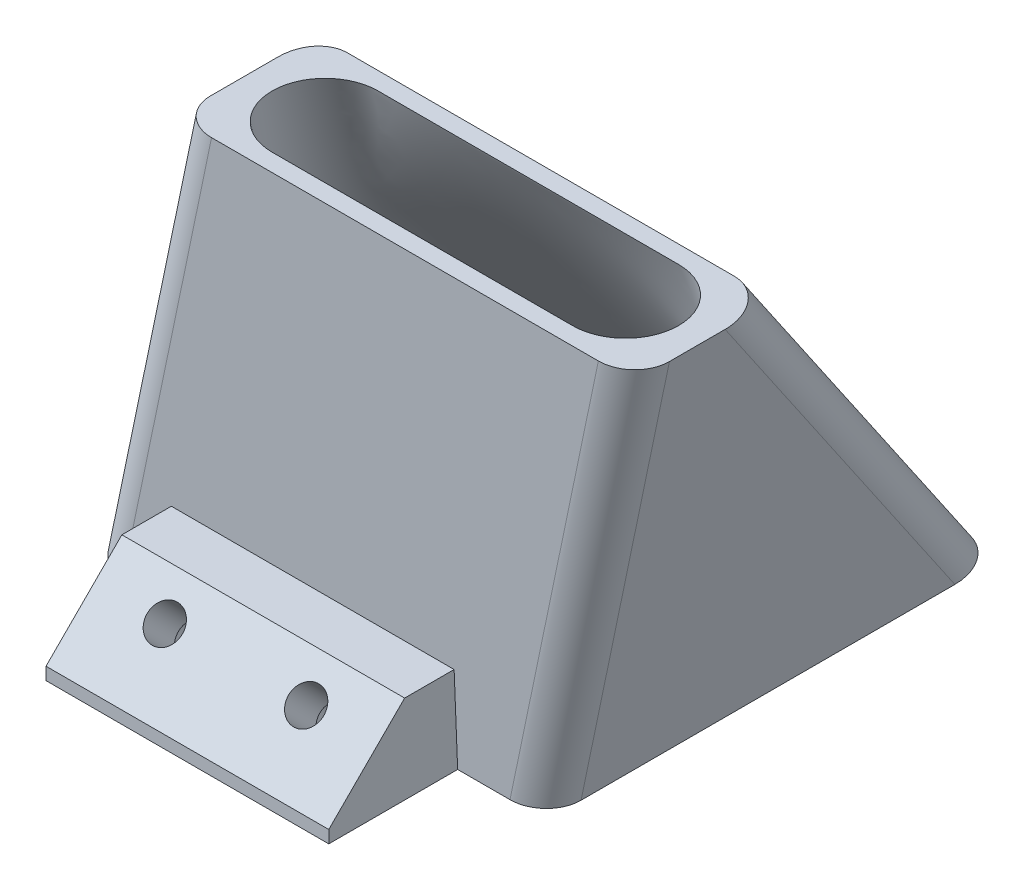
ISO-10303-21;
HEADER;
FILE_DESCRIPTION(('STEP AP214'),'2;1');
FILE_NAME('part.step','',(''),(''),'','','');
FILE_SCHEMA(('AUTOMOTIVE_DESIGN { 1 0 10303 214 1 1 1 1 }'));
ENDSEC;
DATA;
#1=APPLICATION_CONTEXT('core data for automotive mechanical design processes');
#2=APPLICATION_PROTOCOL_DEFINITION('international standard','automotive_design',2000,#1);
#3=PRODUCT_CONTEXT('',#1,'mechanical');
#4=PRODUCT('Part','Part','',(#3));
#5=PRODUCT_RELATED_PRODUCT_CATEGORY('part','',(#4));
#6=PRODUCT_DEFINITION_FORMATION('','',#4);
#7=PRODUCT_DEFINITION_CONTEXT('part definition',#1,'design');
#8=PRODUCT_DEFINITION('design','',#6,#7);
#9=PRODUCT_DEFINITION_SHAPE('','',#8);
#10=(LENGTH_UNIT() NAMED_UNIT(*) SI_UNIT(.MILLI.,.METRE.));
#11=(NAMED_UNIT(*) PLANE_ANGLE_UNIT() SI_UNIT($,.RADIAN.));
#12=(NAMED_UNIT(*) SI_UNIT($,.STERADIAN.) SOLID_ANGLE_UNIT());
#13=UNCERTAINTY_MEASURE_WITH_UNIT(LENGTH_MEASURE(1.E-05),#10,'distance_accuracy_value','');
#14=(GEOMETRIC_REPRESENTATION_CONTEXT(3) GLOBAL_UNCERTAINTY_ASSIGNED_CONTEXT((#13)) GLOBAL_UNIT_ASSIGNED_CONTEXT((#10,
#11,#12)) REPRESENTATION_CONTEXT('',''));
#15=CARTESIAN_POINT('',(0.,0.,0.));
#16=DIRECTION('',(0.,0.,1.));
#17=DIRECTION('',(1.,0.,0.));
#18=AXIS2_PLACEMENT_3D('',#15,#16,#17);
#19=CARTESIAN_POINT('',(0.,25.,0.));
#20=DIRECTION('',(0.,-1.,0.));
#21=DIRECTION('',(0.,0.,-1.));
#22=AXIS2_PLACEMENT_3D('',#19,#20,#21);
#23=PLANE('',#22);
#24=DIRECTION('',(1.,0.,0.));
#25=VECTOR('',#24,1.);
#26=CARTESIAN_POINT('',(14.5,25.,12.9999999999999));
#27=LINE('',#26,#25);
#28=CARTESIAN_POINT('',(-2.49999999820458,25.,12.9999999999999));
#29=VERTEX_POINT('',#28);
#30=CARTESIAN_POINT('',(14.5,25.,12.9999999999999));
#31=VERTEX_POINT('',#30);
#32=EDGE_CURVE('E332',#29,#31,#27,.T.);
#33=ORIENTED_EDGE('',*,*,#32,.F.);
#34=CARTESIAN_POINT('',(-2.5,25.,9.99999999999991));
#35=DIRECTION('',(0.,1.,0.));
#36=DIRECTION('',(0.,0.,1.));
#37=AXIS2_PLACEMENT_3D('',#34,#35,#36);
#38=CIRCLE('',#37,3.00000000000001);
#39=CARTESIAN_POINT('',(-2.49999999999999,25.,6.9999999999999));
#40=VERTEX_POINT('',#39);
#41=EDGE_CURVE('E426',#40,#29,#38,.T.);
#42=ORIENTED_EDGE('',*,*,#41,.F.);
#43=DIRECTION('',(-1.,0.,0.));
#44=VECTOR('',#43,1.);
#45=CARTESIAN_POINT('',(14.5,25.,6.99999999999991));
#46=LINE('',#45,#44);
#47=CARTESIAN_POINT('',(14.4999999998171,25.,6.99999999999991));
#48=VERTEX_POINT('',#47);
#49=EDGE_CURVE('E430',#48,#40,#46,.T.);
#50=ORIENTED_EDGE('',*,*,#49,.F.);
#51=CARTESIAN_POINT('',(14.5,25.,9.99999999999991));
#52=DIRECTION('',(0.,1.,0.));
#53=DIRECTION('',(0.,0.,1.));
#54=AXIS2_PLACEMENT_3D('',#51,#52,#53);
#55=CIRCLE('',#54,3.00000000000001);
#56=EDGE_CURVE('E427',#31,#48,#55,.T.);
#57=ORIENTED_EDGE('',*,*,#56,.F.);
#58=EDGE_LOOP('',(#33,#42,#50,#57));
#59=FACE_BOUND('',#58,.T.);
#60=DIRECTION('',(1.,0.,0.));
#61=VECTOR('',#60,1.);
#62=CARTESIAN_POINT('',(-7.,25.,13.9999999999999));
#63=LINE('',#62,#61);
#64=CARTESIAN_POINT('',(-4.92402172044335,25.,13.9999999999999));
#65=VERTEX_POINT('',#64);
#66=CARTESIAN_POINT('',(16.9623910372583,25.,13.9999999999999));
#67=VERTEX_POINT('',#66);
#68=EDGE_CURVE('E451',#65,#67,#63,.T.);
#69=ORIENTED_EDGE('',*,*,#68,.T.);
#70=CARTESIAN_POINT('',(16.9432063788508,25.,11.9984006394884));
#71=DIRECTION('',(0.,-1.,0.));
#72=DIRECTION('',(0.986393923832146,0.,0.164398987305344));
#73=AXIS2_PLACEMENT_3D('',#70,#71,#72);
#74=ELLIPSE('',#73,2.05834885284298,2.);
#75=CARTESIAN_POINT('',(19.,25.,12.0170704756865));
#76=VERTEX_POINT('',#75);
#77=EDGE_CURVE('E755',#67,#76,#74,.F.);
#78=ORIENTED_EDGE('',*,*,#77,.T.);
#79=DIRECTION('',(0.,0.,-1.));
#80=VECTOR('',#79,1.);
#81=CARTESIAN_POINT('',(19.,25.,13.9999999999999));
#82=LINE('',#81,#80);
#83=CARTESIAN_POINT('',(19.,25.,8.86677784265962));
#84=VERTEX_POINT('',#83);
#85=EDGE_CURVE('E698',#76,#84,#82,.T.);
#86=ORIENTED_EDGE('',*,*,#85,.T.);
#87=CARTESIAN_POINT('',(16.9432063788508,25.,8.51205095489712));
#88=DIRECTION('',(0.,-1.,0.));
#89=DIRECTION('',(0.301131367937099,0.,0.953582665134141));
#90=AXIS2_PLACEMENT_3D('',#87,#88,#89);
#91=ELLIPSE('',#90,2.55749877810332,2.);
#92=CARTESIAN_POINT('',(16.6527664104347,25.,5.99999999999992));
#93=VERTEX_POINT('',#92);
#94=EDGE_CURVE('E751',#84,#93,#91,.F.);
#95=ORIENTED_EDGE('',*,*,#94,.T.);
#96=DIRECTION('',(-1.,0.,0.));
#97=VECTOR('',#96,1.);
#98=CARTESIAN_POINT('',(-7.,25.,5.99999999999992));
#99=LINE('',#98,#97);
#100=CARTESIAN_POINT('',(-5.23364634726691,25.,5.99999999999992));
#101=VERTEX_POINT('',#100);
#102=EDGE_CURVE('E694',#93,#101,#99,.T.);
#103=ORIENTED_EDGE('',*,*,#102,.T.);
#104=CARTESIAN_POINT('',(-4.94320637885081,25.,8.51205095489713));
#105=DIRECTION('',(0.,-1.,0.));
#106=DIRECTION('',(0.301131367937099,0.,0.953582665134141));
#107=AXIS2_PLACEMENT_3D('',#104,#105,#106);
#108=ELLIPSE('',#107,2.55749877810332,2.);
#109=CARTESIAN_POINT('',(-7.,25.,8.15732406713463));
#110=VERTEX_POINT('',#109);
#111=EDGE_CURVE('E747',#101,#110,#108,.F.);
#112=ORIENTED_EDGE('',*,*,#111,.T.);
#113=DIRECTION('',(0.,0.,1.));
#114=VECTOR('',#113,1.);
#115=CARTESIAN_POINT('',(-7.,25.,13.9999999999999));
#116=LINE('',#115,#114);
#117=CARTESIAN_POINT('',(-7.,25.,11.9797308032904));
#118=VERTEX_POINT('',#117);
#119=EDGE_CURVE('E425',#110,#118,#116,.T.);
#120=ORIENTED_EDGE('',*,*,#119,.T.);
#121=CARTESIAN_POINT('',(-4.94320637885081,25.,11.9984006394884));
#122=DIRECTION('',(0.,-1.,0.));
#123=DIRECTION('',(0.986393923832146,0.,0.164398987305344));
#124=AXIS2_PLACEMENT_3D('',#121,#122,#123);
#125=ELLIPSE('',#124,2.05834885284298,2.);
#126=EDGE_CURVE('E661',#118,#65,#125,.F.);
#127=ORIENTED_EDGE('',*,*,#126,.T.);
#128=EDGE_LOOP('',(#69,#78,#86,#95,#103,#112,#120,#127));
#129=FACE_BOUND('',#128,.T.);
#130=ADVANCED_FACE('F138',(#59,#129),#23,.F.);
#131=CARTESIAN_POINT('',(0.,0.,0.));
#132=DIRECTION('',(0.,1.,0.));
#133=DIRECTION('',(0.,0.,1.));
#134=AXIS2_PLACEMENT_3D('',#131,#132,#133);
#135=PLANE('',#134);
#136=CARTESIAN_POINT('',(4.,0.,14.1421356237309));
#137=DIRECTION('',(0.,1.,0.));
#138=DIRECTION('',(0.,0.,1.));
#139=AXIS2_PLACEMENT_3D('',#136,#137,#138);
#140=ELLIPSE('',#139,2.47487373415291,1.75);
#141=CARTESIAN_POINT('',(4.,0.,16.6170093578838));
#142=VERTEX_POINT('',#141);
#143=EDGE_CURVE('E568',#142,#142,#140,.T.);
#144=ORIENTED_EDGE('',*,*,#143,.T.);
#145=EDGE_LOOP('',(#144));
#146=FACE_BOUND('',#145,.T.);
#147=CARTESIAN_POINT('',(-4.,0.,14.1421356237309));
#148=DIRECTION('',(0.,1.,0.));
#149=DIRECTION('',(0.,0.,1.));
#150=AXIS2_PLACEMENT_3D('',#147,#148,#149);
#151=ELLIPSE('',#150,2.47487373415291,1.75);
#152=CARTESIAN_POINT('',(-4.,0.,16.6170093578838));
#153=VERTEX_POINT('',#152);
#154=EDGE_CURVE('E571',#153,#153,#151,.T.);
#155=ORIENTED_EDGE('',*,*,#154,.T.);
#156=EDGE_LOOP('',(#155));
#157=FACE_BOUND('',#156,.T.);
#158=DIRECTION('',(0.,0.,1.));
#159=VECTOR('',#158,1.);
#160=CARTESIAN_POINT('',(8.,0.,21.));
#161=LINE('',#160,#159);
#162=CARTESIAN_POINT('',(8.,0.,13.));
#163=VERTEX_POINT('',#162);
#164=CARTESIAN_POINT('',(8.,0.,20.2928932188134));
#165=VERTEX_POINT('',#164);
#166=EDGE_CURVE('E269',#163,#165,#161,.T.);
#167=ORIENTED_EDGE('',*,*,#166,.T.);
#168=DIRECTION('',(-1.,0.,0.));
#169=VECTOR('',#168,1.);
#170=CARTESIAN_POINT('',(-8.,0.,20.2928932188134));
#171=LINE('',#170,#169);
#172=CARTESIAN_POINT('',(-8.,0.,20.2928932188134));
#173=VERTEX_POINT('',#172);
#174=EDGE_CURVE('E588',#165,#173,#171,.T.);
#175=ORIENTED_EDGE('',*,*,#174,.T.);
#176=DIRECTION('',(0.,0.,-1.));
#177=VECTOR('',#176,1.);
#178=CARTESIAN_POINT('',(-8.,0.,21.));
#179=LINE('',#178,#177);
#180=CARTESIAN_POINT('',(-8.,0.,13.));
#181=VERTEX_POINT('',#180);
#182=EDGE_CURVE('E298',#173,#181,#179,.T.);
#183=ORIENTED_EDGE('',*,*,#182,.T.);
#184=DIRECTION('',(1.,0.,0.));
#185=VECTOR('',#184,1.);
#186=CARTESIAN_POINT('',(-13.,0.,13.));
#187=LINE('',#186,#185);
#188=CARTESIAN_POINT('',(-10.9240217204434,0.,13.));
#189=VERTEX_POINT('',#188);
#190=EDGE_CURVE('E278',#189,#181,#187,.T.);
#191=ORIENTED_EDGE('',*,*,#190,.F.);
#192=CARTESIAN_POINT('',(-10.9432063788508,0.,10.9984006394885));
#193=DIRECTION('',(0.,1.,0.));
#194=DIRECTION('',(0.986393923832146,0.,0.164398987305344));
#195=AXIS2_PLACEMENT_3D('',#192,#193,#194);
#196=ELLIPSE('',#195,2.05834885284298,2.);
#197=CARTESIAN_POINT('',(-13.,0.,10.9797308032905));
#198=VERTEX_POINT('',#197);
#199=EDGE_CURVE('E771',#189,#198,#196,.F.);
#200=ORIENTED_EDGE('',*,*,#199,.T.);
#201=DIRECTION('',(0.,0.,1.));
#202=VECTOR('',#201,1.);
#203=CARTESIAN_POINT('',(-13.,0.,-13.));
#204=LINE('',#203,#202);
#205=CARTESIAN_POINT('',(-13.,0.,-10.8426759328653));
#206=VERTEX_POINT('',#205);
#207=EDGE_CURVE('E279',#206,#198,#204,.T.);
#208=ORIENTED_EDGE('',*,*,#207,.F.);
#209=CARTESIAN_POINT('',(-10.9432063788508,0.,-10.4879490451028));
#210=DIRECTION('',(0.,1.,0.));
#211=DIRECTION('',(0.301131367937099,0.,0.953582665134141));
#212=AXIS2_PLACEMENT_3D('',#209,#210,#211);
#213=ELLIPSE('',#212,2.55749877810332,2.);
#214=CARTESIAN_POINT('',(-11.2336463472669,0.,-13.));
#215=VERTEX_POINT('',#214);
#216=EDGE_CURVE('E1056',#206,#215,#213,.F.);
#217=ORIENTED_EDGE('',*,*,#216,.T.);
#218=DIRECTION('',(-1.,0.,0.));
#219=VECTOR('',#218,1.);
#220=CARTESIAN_POINT('',(-13.,0.,-13.));
#221=LINE('',#220,#219);
#222=CARTESIAN_POINT('',(10.6527664104347,0.,-13.));
#223=VERTEX_POINT('',#222);
#224=EDGE_CURVE('E657',#223,#215,#221,.T.);
#225=ORIENTED_EDGE('',*,*,#224,.F.);
#226=CARTESIAN_POINT('',(10.9432063788508,0.,-10.4879490451028));
#227=DIRECTION('',(0.,1.,0.));
#228=DIRECTION('',(0.301131367937099,0.,0.953582665134141));
#229=AXIS2_PLACEMENT_3D('',#226,#227,#228);
#230=ELLIPSE('',#229,2.55749877810332,2.);
#231=CARTESIAN_POINT('',(13.,0.,-10.1332221573403));
#232=VERTEX_POINT('',#231);
#233=EDGE_CURVE('E1057',#223,#232,#230,.F.);
#234=ORIENTED_EDGE('',*,*,#233,.T.);
#235=DIRECTION('',(0.,0.,-1.));
#236=VECTOR('',#235,1.);
#237=CARTESIAN_POINT('',(13.,0.,-13.));
#238=LINE('',#237,#236);
#239=CARTESIAN_POINT('',(13.,0.,11.0170704756865));
#240=VERTEX_POINT('',#239);
#241=EDGE_CURVE('E630',#240,#232,#238,.T.);
#242=ORIENTED_EDGE('',*,*,#241,.F.);
#243=CARTESIAN_POINT('',(10.9432063788508,0.,10.9984006394885));
#244=DIRECTION('',(0.,1.,0.));
#245=DIRECTION('',(0.986393923832146,0.,0.164398987305344));
#246=AXIS2_PLACEMENT_3D('',#243,#244,#245);
#247=ELLIPSE('',#246,2.05834885284298,2.);
#248=CARTESIAN_POINT('',(10.9623910372583,0.,13.));
#249=VERTEX_POINT('',#248);
#250=EDGE_CURVE('E273',#240,#249,#247,.F.);
#251=ORIENTED_EDGE('',*,*,#250,.T.);
#252=EDGE_CURVE('E262',#163,#249,#187,.T.);
#253=ORIENTED_EDGE('',*,*,#252,.F.);
#254=EDGE_LOOP('',(#167,#175,#183,#191,#200,#208,#217,#225,#234,#242,#251,#253));
#255=FACE_BOUND('',#254,.T.);
#256=CARTESIAN_POINT('',(-10.,0.,-10.));
#257=DIRECTION('',(0.,-1.,0.));
#258=DIRECTION('',(0.,0.,1.));
#259=AXIS2_PLACEMENT_3D('',#256,#257,#258);
#260=CIRCLE('',#259,0.999999999999999);
#261=CARTESIAN_POINT('',(-10.,0.,-9.));
#262=VERTEX_POINT('',#261);
#263=EDGE_CURVE('E308',#262,#262,#260,.T.);
#264=ORIENTED_EDGE('',*,*,#263,.F.);
#265=EDGE_LOOP('',(#264));
#266=FACE_BOUND('',#265,.T.);
#267=CARTESIAN_POINT('',(10.,0.,-10.));
#268=DIRECTION('',(0.,-1.,0.));
#269=DIRECTION('',(0.,0.,-1.));
#270=AXIS2_PLACEMENT_3D('',#267,#268,#269);
#271=CIRCLE('',#270,0.999999999999999);
#272=CARTESIAN_POINT('',(10.,0.,-11.));
#273=VERTEX_POINT('',#272);
#274=EDGE_CURVE('E312',#273,#273,#271,.T.);
#275=ORIENTED_EDGE('',*,*,#274,.F.);
#276=EDGE_LOOP('',(#275));
#277=FACE_BOUND('',#276,.T.);
#278=CARTESIAN_POINT('',(10.,0.,10.));
#279=DIRECTION('',(0.,-1.,0.));
#280=DIRECTION('',(0.,0.,1.));
#281=AXIS2_PLACEMENT_3D('',#278,#279,#280);
#282=CIRCLE('',#281,0.999999999999999);
#283=CARTESIAN_POINT('',(10.,0.,11.));
#284=VERTEX_POINT('',#283);
#285=EDGE_CURVE('E320',#284,#284,#282,.T.);
#286=ORIENTED_EDGE('',*,*,#285,.F.);
#287=EDGE_LOOP('',(#286));
#288=FACE_BOUND('',#287,.T.);
#289=CARTESIAN_POINT('',(-10.,0.,10.));
#290=DIRECTION('',(0.,-1.,0.));
#291=DIRECTION('',(0.,0.,-1.));
#292=AXIS2_PLACEMENT_3D('',#289,#290,#291);
#293=CIRCLE('',#292,0.999999999999999);
#294=CARTESIAN_POINT('',(-10.,0.,9.));
#295=VERTEX_POINT('',#294);
#296=EDGE_CURVE('E319',#295,#295,#293,.T.);
#297=ORIENTED_EDGE('',*,*,#296,.F.);
#298=EDGE_LOOP('',(#297));
#299=FACE_BOUND('',#298,.T.);
#300=CARTESIAN_POINT('',(0.,0.,0.));
#301=DIRECTION('',(0.,-1.,0.));
#302=DIRECTION('',(0.,0.,-1.));
#303=AXIS2_PLACEMENT_3D('',#300,#301,#302);
#304=CIRCLE('',#303,11.5);
#305=CARTESIAN_POINT('',(-10.6402403849438,0.,4.36294448172448));
#306=VERTEX_POINT('',#305);
#307=CARTESIAN_POINT('',(-11.0216045895966,0.,-3.28241256861229));
#308=VERTEX_POINT('',#307);
#309=EDGE_CURVE('E420',#306,#308,#304,.T.);
#310=ORIENTED_EDGE('',*,*,#309,.F.);
#311=CARTESIAN_POINT('',(11.0216045895966,0.,3.2824125686123));
#312=VERTEX_POINT('',#311);
#313=EDGE_CURVE('E326',#312,#306,#304,.T.);
#314=ORIENTED_EDGE('',*,*,#313,.F.);
#315=CARTESIAN_POINT('',(10.6402403851226,0.,-4.36294448128858));
#316=VERTEX_POINT('',#315);
#317=EDGE_CURVE('E422',#316,#312,#304,.T.);
#318=ORIENTED_EDGE('',*,*,#317,.F.);
#319=EDGE_CURVE('E415',#308,#316,#304,.T.);
#320=ORIENTED_EDGE('',*,*,#319,.F.);
#321=EDGE_LOOP('',(#310,#314,#318,#320));
#322=FACE_BOUND('',#321,.T.);
#323=ADVANCED_FACE('F265',(#146,#157,#255,#266,#277,#288,#299,#322),#135,.F.);
#324=CARTESIAN_POINT('',(12.2919818456883,-2.95007564296521,0.));
#325=DIRECTION('',(-0.972387301980517,0.233372952475325,0.));
#326=DIRECTION('',(-0.233372952475325,-0.972387301980517,0.));
#327=AXIS2_PLACEMENT_3D('',#324,#325,#326);
#328=PLANE('',#327);
#329=ORIENTED_EDGE('',*,*,#85,.F.);
#330=DIRECTION('',(0.233196622300942,0.97165259292059,0.0388661037168203));
#331=VECTOR('',#330,1.);
#332=CARTESIAN_POINT('',(12.1931987570179,-3.36167184575852,10.8826036018562));
#333=LINE('',#332,#331);
#334=EDGE_CURVE('E767',#76,#240,#333,.F.);
#335=ORIENTED_EDGE('',*,*,#334,.T.);
#336=ORIENTED_EDGE('',*,*,#241,.T.);
#337=DIRECTION('',(0.187683374126957,0.782014058862319,0.59433068473536));
#338=VECTOR('',#337,1.);
#339=CARTESIAN_POINT('',(13.6723946437738,2.80164434905737,-8.00397245205671));
#340=LINE('',#339,#338);
#341=EDGE_CURVE('E759',#232,#84,#340,.T.);
#342=ORIENTED_EDGE('',*,*,#341,.T.);
#343=EDGE_LOOP('',(#329,#335,#336,#342));
#344=FACE_BOUND('',#343,.T.);
#345=ADVANCED_FACE('F559',(#344),#328,.F.);
#346=CARTESIAN_POINT('',(0.,-0.519169329073439,12.9792332268371));
#347=DIRECTION('',(0.,0.0399680383488682,-0.999200958721789));
#348=DIRECTION('',(0.,0.99920095872179,0.0399680383488682));
#349=AXIS2_PLACEMENT_3D('',#346,#347,#348);
#350=PLANE('',#349);
#351=ORIENTED_EDGE('',*,*,#190,.T.);
#352=DIRECTION('',(0.,0.99920095872179,0.0399680383488682));
#353=VECTOR('',#352,1.);
#354=CARTESIAN_POINT('',(-8.,-0.519169329073439,12.9792332268371));
#355=LINE('',#354,#353);
#356=CARTESIAN_POINT('',(-8.,5.,13.2));
#357=VERTEX_POINT('',#356);
#358=EDGE_CURVE('E293',#181,#357,#355,.T.);
#359=ORIENTED_EDGE('',*,*,#358,.T.);
#360=DIRECTION('',(-1.,0.,0.));
#361=VECTOR('',#360,1.);
#362=CARTESIAN_POINT('',(0.,5.,13.2));
#363=LINE('',#362,#361);
#364=CARTESIAN_POINT('',(8.,5.,13.2));
#365=VERTEX_POINT('',#364);
#366=EDGE_CURVE('E289',#365,#357,#363,.T.);
#367=ORIENTED_EDGE('',*,*,#366,.F.);
#368=DIRECTION('',(0.,-0.99920095872179,-0.0399680383488682));
#369=VECTOR('',#368,1.);
#370=CARTESIAN_POINT('',(8.,-0.519169329073439,12.9792332268371));
#371=LINE('',#370,#369);
#372=EDGE_CURVE('E284',#365,#163,#371,.T.);
#373=ORIENTED_EDGE('',*,*,#372,.T.);
#374=ORIENTED_EDGE('',*,*,#252,.T.);
#375=DIRECTION('',(0.233196622300942,0.97165259292059,0.0388661037168203));
#376=VECTOR('',#375,1.);
#377=CARTESIAN_POINT('',(10.2484241530569,-2.97486201750561,12.8810055192998));
#378=LINE('',#377,#376);
#379=EDGE_CURVE('E656',#249,#67,#378,.T.);
#380=ORIENTED_EDGE('',*,*,#379,.T.);
#381=ORIENTED_EDGE('',*,*,#68,.F.);
#382=DIRECTION('',(0.233196622300942,0.97165259292059,0.0388661037168203));
#383=VECTOR('',#382,1.);
#384=CARTESIAN_POINT('',(-10.4477909320204,1.98429495176213,13.0793717980705));
#385=LINE('',#384,#383);
#386=EDGE_CURVE('E654',#65,#189,#385,.F.);
#387=ORIENTED_EDGE('',*,*,#386,.T.);
#388=EDGE_LOOP('',(#351,#359,#367,#373,#374,#380,#381,#387));
#389=FACE_BOUND('',#388,.T.);
#390=ADVANCED_FACE('F286',(#389),#350,.F.);
#391=CARTESIAN_POINT('',(0.,6.26267748478701,-8.24036511156189));
#392=DIRECTION('',(0.,-0.605083267533556,0.796162194123104));
#393=DIRECTION('',(0.,-0.796162194123104,-0.605083267533556));
#394=AXIS2_PLACEMENT_3D('',#391,#392,#393);
#395=PLANE('',#394);
#396=ORIENTED_EDGE('',*,*,#102,.F.);
#397=DIRECTION('',(0.187683374126957,0.782014058862319,0.59433068473536));
#398=VECTOR('',#397,1.);
#399=CARTESIAN_POINT('',(11.7276200398127,4.47855678907513,-9.59629684030292));
#400=LINE('',#399,#398);
#401=EDGE_CURVE('E811',#93,#223,#400,.F.);
#402=ORIENTED_EDGE('',*,*,#401,.T.);
#403=ORIENTED_EDGE('',*,*,#224,.T.);
#404=DIRECTION('',(0.187683374126957,0.782014058862319,0.59433068473536));
#405=VECTOR('',#404,1.);
#406=CARTESIAN_POINT('',(-9.38784275773501,7.69084828971628,-7.15495529981566));
#407=LINE('',#406,#405);
#408=CARTESIAN_POINT('',(-10.5500116997172,2.84847769812395,-10.8351569494258));
#409=VERTEX_POINT('',#408);
#410=EDGE_CURVE('E1071',#215,#409,#407,.T.);
#411=ORIENTED_EDGE('',*,*,#410,.T.);
#412=CARTESIAN_POINT('',(-10.,3.94736842105265,-10.));
#413=DIRECTION('',(0.,-0.605083267533556,0.796162194123104));
#414=DIRECTION('',(0.,-0.796162194123104,-0.605083267533556));
#415=AXIS2_PLACEMENT_3D('',#412,#413,#414);
#416=ELLIPSE('',#415,1.65266510190606,0.999999999999999);
#417=CARTESIAN_POINT('',(-9.97062473032492,5.26259007059165,-9.00043154635037));
#418=VERTEX_POINT('',#417);
#419=EDGE_CURVE('E311',#409,#418,#416,.T.);
#420=ORIENTED_EDGE('',*,*,#419,.T.);
#421=DIRECTION('',(0.187683374126957,0.782014058862319,0.59433068473536));
#422=VECTOR('',#421,1.);
#423=CARTESIAN_POINT('',(-9.38784275773501,7.69084828971628,-7.15495529981566));
#424=LINE('',#423,#422);
#425=EDGE_CURVE('E1067',#418,#101,#424,.T.);
#426=ORIENTED_EDGE('',*,*,#425,.T.);
#427=EDGE_LOOP('',(#396,#402,#403,#411,#420,#426));
#428=FACE_BOUND('',#427,.T.);
#429=CARTESIAN_POINT('',(10.,3.94736842105265,-10.));
#430=DIRECTION('',(0.,-0.605083267533556,0.796162194123104));
#431=DIRECTION('',(0.,-0.796162194123104,-0.605083267533556));
#432=AXIS2_PLACEMENT_3D('',#429,#430,#431);
#433=ELLIPSE('',#432,1.65266510190606,0.999999999999999);
#434=CARTESIAN_POINT('',(10.,2.63157894736844,-11.));
#435=VERTEX_POINT('',#434);
#436=EDGE_CURVE('E315',#435,#435,#433,.T.);
#437=ORIENTED_EDGE('',*,*,#436,.T.);
#438=EDGE_LOOP('',(#437));
#439=FACE_BOUND('',#438,.T.);
#440=ADVANCED_FACE('F717',(#428,#439),#395,.F.);
#441=CARTESIAN_POINT('',(-12.2919818456884,2.95007564296521,0.));
#442=DIRECTION('',(0.972387301980517,-0.233372952475324,0.));
#443=DIRECTION('',(0.233372952475324,0.972387301980517,0.));
#444=AXIS2_PLACEMENT_3D('',#441,#442,#443);
#445=PLANE('',#444);
#446=ORIENTED_EDGE('',*,*,#119,.F.);
#447=DIRECTION('',(0.187683374126957,0.782014058862319,0.59433068473536));
#448=VECTOR('',#447,1.);
#449=CARTESIAN_POINT('',(-11.332617361696,6.94742765959981,-5.56263091156945));
#450=LINE('',#449,#448);
#451=EDGE_CURVE('E798',#110,#206,#450,.F.);
#452=ORIENTED_EDGE('',*,*,#451,.T.);
#453=ORIENTED_EDGE('',*,*,#207,.T.);
#454=DIRECTION('',(0.233196622300942,0.97165259292059,0.0388661037168203));
#455=VECTOR('',#454,1.);
#456=CARTESIAN_POINT('',(-12.3925655359815,2.53097693341052,11.0809698806269));
#457=LINE('',#456,#455);
#458=EDGE_CURVE('E800',#198,#118,#457,.T.);
#459=ORIENTED_EDGE('',*,*,#458,.T.);
#460=EDGE_LOOP('',(#446,#452,#453,#459));
#461=FACE_BOUND('',#460,.T.);
#462=ADVANCED_FACE('F352',(#461),#445,.F.);
#463=CARTESIAN_POINT('',(-2.49999999820458,25.,12.9999999999999));
#464=CARTESIAN_POINT('',(-10.6402403849438,0.,4.36294448172448));
#465=CARTESIAN_POINT('',(-2.81526125219568,25.,12.9999999999999));
#466=CARTESIAN_POINT('',(-10.8037671362267,0.,3.96413951170701));
#467=CARTESIAN_POINT('',(-3.48518305167077,25.0000000000001,12.9006204718999));
#468=CARTESIAN_POINT('',(-11.0413822433789,0.,3.26632807008249));
#469=CARTESIAN_POINT('',(-4.49375113023656,24.9999999999999,12.3482025138626));
#470=CARTESIAN_POINT('',(-11.2754621249926,0.,2.3253907760856));
#471=CARTESIAN_POINT('',(-5.29167901815688,25.0000000000001,11.3415272283433));
#472=CARTESIAN_POINT('',(-11.420477177352,0.,1.43974941400559));
#473=CARTESIAN_POINT('',(-5.60497729700984,25.,9.99999999999994));
#474=CARTESIAN_POINT('',(-11.4967524390815,0.,0.573481706152424));
#475=CARTESIAN_POINT('',(-5.29167901815686,25.,8.6584727716565));
#476=CARTESIAN_POINT('',(-11.5071086948946,0.,-0.296015988010232));
#477=CARTESIAN_POINT('',(-4.49375113023657,25.,7.65179748613722));
#478=CARTESIAN_POINT('',(-11.4508849452292,0.,-1.19179242928072));
#479=CARTESIAN_POINT('',(-3.48518305167076,25.,7.09937952809989));
#480=CARTESIAN_POINT('',(-11.311633740644,0.,-2.15130198351375));
#481=CARTESIAN_POINT('',(-2.81526125219568,25.,6.99999999999991));
#482=CARTESIAN_POINT('',(-11.1446321150282,0.,-2.86931375467572));
#483=CARTESIAN_POINT('',(-1.71422883967938,25.,6.99999999999991));
#484=CARTESIAN_POINT('',(-10.7149653178397,0.,-4.31203841067227));
#485=CARTESIAN_POINT('',(-0.209201496978708,25.,6.99999999999991));
#486=CARTESIAN_POINT('',(-9.7915212882665,0.,-6.3504391194931));
#487=CARTESIAN_POINT('',(1.91555403210623,25.,6.99999999999991));
#488=CARTESIAN_POINT('',(-7.4463321081483,0.,-9.00875305051836));
#489=CARTESIAN_POINT('',(3.97428352508072,25.,6.99999999999991));
#490=CARTESIAN_POINT('',(-4.2714417090761,0.,-10.8924885301232));
#491=CARTESIAN_POINT('',(6.,25.,6.9999999999999));
#492=CARTESIAN_POINT('',(-0.583125068405685,0.,-11.6901358344804));
#493=CARTESIAN_POINT('',(8.02571647491928,25.,6.9999999999999));
#494=CARTESIAN_POINT('',(3.16626129480691,0.,-11.2634945761033));
#495=CARTESIAN_POINT('',(10.0844459678938,25.,6.99999999999991));
#496=CARTESIAN_POINT('',(6.51285322727913,0.,-9.70506240216845));
#497=CARTESIAN_POINT('',(12.2092014969787,25.,6.99999999999991));
#498=CARTESIAN_POINT('',(9.11094555278082,0.,-7.29332827200502));
#499=CARTESIAN_POINT('',(13.7142288396794,25.,6.99999999999991));
#500=CARTESIAN_POINT('',(10.2326590435049,0.,-5.35694371045648));
#501=CARTESIAN_POINT('',(14.8152612521957,25.,6.99999999999991));
#502=CARTESIAN_POINT('',(10.8037671362267,0.,-3.96413951170701));
#503=CARTESIAN_POINT('',(15.4851830516708,25.,7.09937952809991));
#504=CARTESIAN_POINT('',(11.0413822433789,0.,-3.26632807008248));
#505=CARTESIAN_POINT('',(16.4937511302366,25.,7.65179748613718));
#506=CARTESIAN_POINT('',(11.2754621249926,0.,-2.3253907760856));
#507=CARTESIAN_POINT('',(17.2916790181569,25.,8.65847277165655));
#508=CARTESIAN_POINT('',(11.420477177352,0.,-1.43974941400558));
#509=CARTESIAN_POINT('',(17.6049772970098,25.,9.99999999999989));
#510=CARTESIAN_POINT('',(11.4967524390815,0.,-0.573481706152415));
#511=CARTESIAN_POINT('',(17.2916790181569,25.,11.3415272283433));
#512=CARTESIAN_POINT('',(11.5071086948946,0.,0.296015988010235));
#513=CARTESIAN_POINT('',(16.4937511302365,25.,12.3482025138626));
#514=CARTESIAN_POINT('',(11.4508849452292,0.,1.19179242928073));
#515=CARTESIAN_POINT('',(15.4851830516708,25.,12.9006204718999));
#516=CARTESIAN_POINT('',(11.311633740644,0.,2.15130198351375));
#517=CARTESIAN_POINT('',(14.8152612521957,25.,12.9999999999999));
#518=CARTESIAN_POINT('',(11.1446321150282,0.,2.86931375467572));
#519=CARTESIAN_POINT('',(13.7142288396794,25.,12.9999999999999));
#520=CARTESIAN_POINT('',(10.7149653178397,0.,4.31203841067227));
#521=CARTESIAN_POINT('',(12.2092014969787,25.,12.9999999999999));
#522=CARTESIAN_POINT('',(9.79152128826649,0.,6.35043911949313));
#523=CARTESIAN_POINT('',(10.0844459678938,25.,12.9999999999999));
#524=CARTESIAN_POINT('',(7.4463321081483,0.,9.00875305051834));
#525=CARTESIAN_POINT('',(8.02571647491927,25.,12.9999999999999));
#526=CARTESIAN_POINT('',(4.27144170907609,0.,10.8924885301233));
#527=CARTESIAN_POINT('',(6.00000000000001,25.,12.9999999999999));
#528=CARTESIAN_POINT('',(0.58312506840568,0.,11.6901358344804));
#529=CARTESIAN_POINT('',(3.97428352508073,25.,12.9999999999999));
#530=CARTESIAN_POINT('',(-3.16626129480693,0.,11.2634945761033));
#531=CARTESIAN_POINT('',(1.91555403210623,25.,12.9999999999999));
#532=CARTESIAN_POINT('',(-6.51285322727912,0.,9.70506240216842));
#533=CARTESIAN_POINT('',(-0.209201496978711,25.,12.9999999999999));
#534=CARTESIAN_POINT('',(-9.11094555278084,0.,7.29332827200504));
#535=CARTESIAN_POINT('',(-1.71422883967938,25.,12.9999999999999));
#536=CARTESIAN_POINT('',(-10.2326590435049,0.,5.35694371045648));
#537=CARTESIAN_POINT('',(-2.49999999820458,25.,12.9999999999999));
#538=CARTESIAN_POINT('',(-10.6402403849438,0.,4.36294448172448));
#539=B_SPLINE_SURFACE_WITH_KNOTS('',3,1,((#463,#464),(#465,#466),(#467,#468),(#469,#470),(#471,
#472),(#473,#474),(#475,#476),(#477,#478),(#479,#480),(#481,#482),(#483,#484),(#485,#486),(#487,
#488),(#489,#490),(#491,#492),(#493,#494),(#495,#496),(#497,#498),(#499,#500),(#501,#502),(#503,
#504),(#505,#506),(#507,#508),(#509,#510),(#511,#512),(#513,#514),(#515,#516),(#517,#518),(#519,
#520),(#521,#522),(#523,#524),(#525,#526),(#527,#528),(#529,#530),(#531,#532),(#533,#534),(#535,
#536),(#537,#538)),.UNSPECIFIED.,.T.,.F.,.F.,(4,1,1,1,1,1,1,1,2,1,1,1,1,1,1,1,2,1,1,1,1,1,1,1,2,
1,1,1,1,1,1,1,4),(2,2),(0.,0.0178957750475415,0.035791550095083,0.0536873251426245,
0.071583100190166,0.0894788752377075,0.107374650285249,0.125270425332791,0.143166200380332,
0.187770425332791,0.232374650285249,0.276978875237708,0.321583100190166,0.366187325142625,
0.410791550095083,0.455395775047541,0.5,0.517895775047541,0.535791550095083,0.553687325142625,
0.571583100190166,0.589478875237708,0.607374650285249,0.625270425332791,0.643166200380332,
0.687770425332791,0.732374650285249,0.776978875237708,0.821583100190166,0.866187325142624,
0.910791550095083,0.955395775047541,1.),(0.,1.),.UNSPECIFIED.);
#540=ORIENTED_EDGE('',*,*,#41,.T.);
#541=ORIENTED_EDGE('',*,*,#32,.T.);
#542=ORIENTED_EDGE('',*,*,#56,.T.);
#543=ORIENTED_EDGE('',*,*,#49,.T.);
#544=EDGE_LOOP('',(#540,#541,#542,#543));
#545=FACE_BOUND('',#544,.T.);
#546=ORIENTED_EDGE('',*,*,#313,.T.);
#547=ORIENTED_EDGE('',*,*,#309,.T.);
#548=ORIENTED_EDGE('',*,*,#319,.T.);
#549=ORIENTED_EDGE('',*,*,#317,.T.);
#550=EDGE_LOOP('',(#546,#547,#548,#549));
#551=FACE_BOUND('',#550,.T.);
#552=ADVANCED_FACE('F339',(#545,#551),#539,.F.);
#553=CARTESIAN_POINT('',(-10.,6.,10.));
#554=DIRECTION('',(0.,-1.,0.));
#555=DIRECTION('',(0.,0.,-1.));
#556=AXIS2_PLACEMENT_3D('',#553,#554,#555);
#557=CYLINDRICAL_SURFACE('',#556,0.999999999999999);
#558=CARTESIAN_POINT('',(-10.,6.,10.));
#559=DIRECTION('',(0.,-1.,0.));
#560=DIRECTION('',(0.,0.,-1.));
#561=AXIS2_PLACEMENT_3D('',#558,#559,#560);
#562=CIRCLE('',#561,0.999999999999999);
#563=CARTESIAN_POINT('',(-10.,6.,9.));
#564=VERTEX_POINT('',#563);
#565=EDGE_CURVE('E323',#564,#564,#562,.T.);
#566=ORIENTED_EDGE('',*,*,#565,.F.);
#567=EDGE_LOOP('',(#566));
#568=FACE_BOUND('',#567,.T.);
#569=ORIENTED_EDGE('',*,*,#296,.T.);
#570=EDGE_LOOP('',(#569));
#571=FACE_BOUND('',#570,.T.);
#572=ADVANCED_FACE('F351',(#568,#571),#557,.F.);
#573=CARTESIAN_POINT('',(-10.,6.,10.));
#574=DIRECTION('',(0.,-1.,0.));
#575=DIRECTION('',(0.,0.,-1.));
#576=AXIS2_PLACEMENT_3D('',#573,#574,#575);
#577=PLANE('',#576);
#578=ORIENTED_EDGE('',*,*,#565,.T.);
#579=EDGE_LOOP('',(#578));
#580=FACE_BOUND('',#579,.T.);
#581=ADVANCED_FACE('F835',(#580),#577,.T.);
#582=CARTESIAN_POINT('',(10.,6.,10.));
#583=DIRECTION('',(0.,-1.,0.));
#584=DIRECTION('',(0.,0.,-1.));
#585=AXIS2_PLACEMENT_3D('',#582,#583,#584);
#586=CYLINDRICAL_SURFACE('',#585,0.999999999999999);
#587=CARTESIAN_POINT('',(10.,6.,10.));
#588=DIRECTION('',(0.,-1.,0.));
#589=DIRECTION('',(0.,0.,1.));
#590=AXIS2_PLACEMENT_3D('',#587,#588,#589);
#591=CIRCLE('',#590,0.999999999999999);
#592=CARTESIAN_POINT('',(10.,6.,11.));
#593=VERTEX_POINT('',#592);
#594=EDGE_CURVE('E316',#593,#593,#591,.T.);
#595=ORIENTED_EDGE('',*,*,#594,.F.);
#596=EDGE_LOOP('',(#595));
#597=FACE_BOUND('',#596,.T.);
#598=ORIENTED_EDGE('',*,*,#285,.T.);
#599=EDGE_LOOP('',(#598));
#600=FACE_BOUND('',#599,.T.);
#601=ADVANCED_FACE('F832',(#597,#600),#586,.F.);
#602=CARTESIAN_POINT('',(10.,6.,10.));
#603=DIRECTION('',(0.,1.,0.));
#604=DIRECTION('',(0.,0.,1.));
#605=AXIS2_PLACEMENT_3D('',#602,#603,#604);
#606=PLANE('',#605);
#607=ORIENTED_EDGE('',*,*,#594,.T.);
#608=EDGE_LOOP('',(#607));
#609=FACE_BOUND('',#608,.T.);
#610=ADVANCED_FACE('F828',(#609),#606,.F.);
#611=CARTESIAN_POINT('',(10.,6.,-10.));
#612=DIRECTION('',(0.,-1.,0.));
#613=DIRECTION('',(0.,0.,-1.));
#614=AXIS2_PLACEMENT_3D('',#611,#612,#613);
#615=CYLINDRICAL_SURFACE('',#614,0.999999999999999);
#616=ORIENTED_EDGE('',*,*,#274,.T.);
#617=EDGE_LOOP('',(#616));
#618=FACE_BOUND('',#617,.T.);
#619=ORIENTED_EDGE('',*,*,#436,.F.);
#620=EDGE_LOOP('',(#619));
#621=FACE_BOUND('',#620,.T.);
#622=ADVANCED_FACE('F822',(#618,#621),#615,.F.);
#623=CARTESIAN_POINT('',(-10.,6.,-10.));
#624=DIRECTION('',(0.,-1.,0.));
#625=DIRECTION('',(0.,0.,-1.));
#626=AXIS2_PLACEMENT_3D('',#623,#624,#625);
#627=CYLINDRICAL_SURFACE('',#626,0.999999999999999);
#628=ORIENTED_EDGE('',*,*,#263,.T.);
#629=EDGE_LOOP('',(#628));
#630=FACE_BOUND('',#629,.T.);
#631=ORIENTED_EDGE('',*,*,#419,.F.);
#632=CARTESIAN_POINT('',(-10.5500116997172,2.84847769812395,-10.8351569494258));
#633=CARTESIAN_POINT('',(-10.5788239139958,2.87343642628271,-10.8161920261472));
#634=CARTESIAN_POINT('',(-10.6064317730649,2.89873084798667,-10.7958640477968));
#635=CARTESIAN_POINT('',(-10.6590331002062,2.95000394815738,-10.7528769451434));
#636=CARTESIAN_POINT('',(-10.6840282549696,2.97598217144806,-10.7302193437608));
#637=CARTESIAN_POINT('',(-10.7311014474035,3.02851746641046,-10.6830774936545));
#638=CARTESIAN_POINT('',(-10.7531953478815,3.05507037886825,-10.6586044304721));
#639=CARTESIAN_POINT('',(-10.7945240961406,3.10891183016467,-10.6081096348499));
#640=CARTESIAN_POINT('',(-10.8137585270428,3.13620047558126,-10.5820876773712));
#641=CARTESIAN_POINT('',(-10.8683996310098,3.22126625893824,-10.5002778452213));
#642=CARTESIAN_POINT('',(-10.8989952147546,3.28031837380697,-10.442530452223));
#643=CARTESIAN_POINT('',(-10.9478266844526,3.40156725754495,-10.3250950519479));
#644=CARTESIAN_POINT('',(-10.96604582785,3.46376816436336,-10.2654045299138));
#645=CARTESIAN_POINT('',(-10.9873746633124,3.57207100437958,-10.1640921287812));
#646=CARTESIAN_POINT('',(-10.993355605723,3.61751154062403,-10.1223325367642));
#647=CARTESIAN_POINT('',(-11.0000750902068,3.70954136540859,-10.0396367885982));
#648=CARTESIAN_POINT('',(-11.0008118134589,3.75613104687876,-9.99870092304504));
#649=CARTESIAN_POINT('',(-10.9974530340749,3.85032573698649,-9.91800674590913));
#650=CARTESIAN_POINT('',(-10.9933460518303,3.89793289405321,-9.87825146161343));
#651=CARTESIAN_POINT('',(-10.9806521174629,3.99382156874402,-9.80029678646162));
#652=CARTESIAN_POINT('',(-10.9720645512239,4.04210317792655,-9.7620976096621));
#653=CARTESIAN_POINT('',(-10.9505119999591,4.13989943365916,-9.68681269625128));
#654=CARTESIAN_POINT('',(-10.9374754536246,4.18942112534973,-9.64975670780892));
#655=CARTESIAN_POINT('',(-10.9072490384789,4.28858113329355,-9.57759101041986));
#656=CARTESIAN_POINT('',(-10.8900608117753,4.33821939577174,-9.54248053869949));
#657=CARTESIAN_POINT('',(-10.8516220461922,4.43715619809844,-9.47439137606552));
#658=CARTESIAN_POINT('',(-10.8303832805088,4.4864553037249,-9.44140686877035));
#659=CARTESIAN_POINT('',(-10.7836755615916,4.58445980236253,-9.37757066943486));
#660=CARTESIAN_POINT('',(-10.7582056225344,4.63316505416605,-9.34671947681466));
#661=CARTESIAN_POINT('',(-10.7057625609276,4.72407871042618,-9.29062970559592));
#662=CARTESIAN_POINT('',(-10.6792659818577,4.76641064363831,-9.26514754067514));
#663=CARTESIAN_POINT('',(-10.6222457733922,4.84950692250731,-9.21627840553556));
#664=CARTESIAN_POINT('',(-10.5917261508627,4.89027277644651,-9.19288938899784));
#665=CARTESIAN_POINT('',(-10.5257078551898,4.96965563210391,-9.14839381184824));
#666=CARTESIAN_POINT('',(-10.4901694021936,5.00825163764686,-9.12730813968772));
#667=CARTESIAN_POINT('',(-10.413352859629,5.08119653923095,-9.08841398694556));
#668=CARTESIAN_POINT('',(-10.3720896998688,5.11555605727788,-9.07059725310275));
#669=CARTESIAN_POINT('',(-10.3027081009237,5.16314048133199,-9.04655947178042));
#670=CARTESIAN_POINT('',(-10.2769432058968,5.17895347250621,-9.0387122695148));
#671=CARTESIAN_POINT('',(-10.2232251846955,5.20739977729622,-9.02483954238131));
#672=CARTESIAN_POINT('',(-10.1952738659129,5.22003568156032,-9.01881253248701));
#673=CARTESIAN_POINT('',(-10.1418493761641,5.23938624509896,-9.00980010257502));
#674=CARTESIAN_POINT('',(-10.1166569339234,5.24671292740071,-9.00648931683017));
#675=CARTESIAN_POINT('',(-10.0653132376588,5.2575142855595,-9.00180616259444));
#676=CARTESIAN_POINT('',(-10.0391648884961,5.26099976813465,-9.00042835292449));
#677=CARTESIAN_POINT('',(-9.9988258535756,5.26305185013007,-8.99989825652859));
#678=CARTESIAN_POINT('',(-9.98470843869359,5.2631493019418,-9.00001058162325));
#679=CARTESIAN_POINT('',(-9.97062473032492,5.26259007059165,-9.00043154635037));
#680=B_SPLINE_CURVE_WITH_KNOTS('',3,(#632,#633,#634,#635,#636,#637,#638,#639,#640,#641,#642,
#643,#644,#645,#646,#647,#648,#649,#650,#651,#652,#653,#654,#655,#656,#657,#658,#659,#660,#661,
#662,#663,#664,#665,#666,#667,#668,#669,#670,#671,#672,#673,#674,#675,#676,#677,#678,#679),
.UNSPECIFIED.,.F.,.F.,(4,2,2,2,2,2,2,2,2,2,2,2,2,2,2,2,2,2,2,2,2,2,2,4),(0.,0.127673360425553,
0.255263782611794,0.382124644619518,0.509003983438166,0.772119545913059,1.03559033984527,
1.221368465351,1.40721102002698,1.59349490912447,1.77980433730885,1.96926401883608,
2.15864888603388,2.34749145749369,2.53637808935529,2.70440738815293,2.87227058026046,
3.04154793153088,3.21039183462021,3.30387297364781,3.39727763760685,3.47630606094317,
3.55511157591557,3.59740267835264),.UNSPECIFIED.);
#681=EDGE_CURVE('E804',#409,#418,#680,.T.);
#682=ORIENTED_EDGE('',*,*,#681,.T.);
#683=EDGE_LOOP('',(#631,#682));
#684=FACE_BOUND('',#683,.T.);
#685=ADVANCED_FACE('F817',(#630,#684),#627,.F.);
#686=CARTESIAN_POINT('',(10.2484241530569,-2.89492594080787,10.8826036018562));
#687=DIRECTION('',(0.233196622300942,0.971652592920589,0.0388661037168203));
#688=DIRECTION('',(-0.972387301980517,0.233372952475325,0.));
#689=AXIS2_PLACEMENT_3D('',#686,#687,#688);
#690=CYLINDRICAL_SURFACE('',#689,2.);
#691=ORIENTED_EDGE('',*,*,#250,.F.);
#692=ORIENTED_EDGE('',*,*,#334,.F.);
#693=ORIENTED_EDGE('',*,*,#77,.F.);
#694=ORIENTED_EDGE('',*,*,#379,.F.);
#695=EDGE_LOOP('',(#691,#692,#693,#694));
#696=FACE_BOUND('',#695,.T.);
#697=ADVANCED_FACE('F474',(#696),#690,.T.);
#698=CARTESIAN_POINT('',(11.7276200398127,3.26839025400802,-8.00397245205671));
#699=DIRECTION('',(0.187683374126957,0.782014058862319,0.59433068473536));
#700=DIRECTION('',(0.,-0.605083267533556,0.796162194123104));
#701=AXIS2_PLACEMENT_3D('',#698,#699,#700);
#702=CYLINDRICAL_SURFACE('',#701,2.);
#703=ORIENTED_EDGE('',*,*,#233,.F.);
#704=ORIENTED_EDGE('',*,*,#401,.F.);
#705=ORIENTED_EDGE('',*,*,#94,.F.);
#706=ORIENTED_EDGE('',*,*,#341,.F.);
#707=EDGE_LOOP('',(#703,#704,#705,#706));
#708=FACE_BOUND('',#707,.T.);
#709=ADVANCED_FACE('F924',(#708),#702,.T.);
#710=CARTESIAN_POINT('',(-9.38784275773501,6.48068175464917,-5.56263091156945));
#711=DIRECTION('',(0.187683374126957,0.782014058862319,0.59433068473536));
#712=DIRECTION('',(0.,-0.605083267533556,0.796162194123104));
#713=AXIS2_PLACEMENT_3D('',#710,#711,#712);
#714=CYLINDRICAL_SURFACE('',#713,2.);
#715=ORIENTED_EDGE('',*,*,#216,.F.);
#716=ORIENTED_EDGE('',*,*,#451,.F.);
#717=ORIENTED_EDGE('',*,*,#111,.F.);
#718=ORIENTED_EDGE('',*,*,#425,.F.);
#719=ORIENTED_EDGE('',*,*,#681,.F.);
#720=ORIENTED_EDGE('',*,*,#410,.F.);
#721=EDGE_LOOP('',(#715,#716,#717,#718,#719,#720));
#722=FACE_BOUND('',#721,.T.);
#723=ADVANCED_FACE('F814',(#722),#714,.T.);
#724=CARTESIAN_POINT('',(-10.4477909320204,2.06423102845987,11.0809698806269));
#725=DIRECTION('',(0.233196622300942,0.97165259292059,0.0388661037168203));
#726=DIRECTION('',(-0.972387301980518,0.233372952475324,0.));
#727=AXIS2_PLACEMENT_3D('',#724,#725,#726);
#728=CYLINDRICAL_SURFACE('',#727,2.);
#729=ORIENTED_EDGE('',*,*,#199,.F.);
#730=ORIENTED_EDGE('',*,*,#386,.F.);
#731=ORIENTED_EDGE('',*,*,#126,.F.);
#732=ORIENTED_EDGE('',*,*,#458,.F.);
#733=EDGE_LOOP('',(#729,#730,#731,#732));
#734=FACE_BOUND('',#733,.T.);
#735=ADVANCED_FACE('F937',(#734),#728,.T.);
#736=CARTESIAN_POINT('',(-8.,5.,21.));
#737=DIRECTION('',(-1.,0.,0.));
#738=DIRECTION('',(0.,0.,1.));
#739=AXIS2_PLACEMENT_3D('',#736,#737,#738);
#740=PLANE('',#739);
#741=ORIENTED_EDGE('',*,*,#182,.F.);
#742=DIRECTION('',(0.,1.,0.));
#743=VECTOR('',#742,1.);
#744=CARTESIAN_POINT('',(-8.,5.,20.2928932188135));
#745=LINE('',#744,#743);
#746=CARTESIAN_POINT('',(-8.,0.707106781186559,20.2928932188135));
#747=VERTEX_POINT('',#746);
#748=EDGE_CURVE('E160',#173,#747,#745,.T.);
#749=ORIENTED_EDGE('',*,*,#748,.T.);
#750=DIRECTION('',(0.,0.707106781186547,-0.707106781186549));
#751=VECTOR('',#750,1.);
#752=CARTESIAN_POINT('',(-8.,2.5,18.5));
#753=LINE('',#752,#751);
#754=CARTESIAN_POINT('',(-8.,5.,16.));
#755=VERTEX_POINT('',#754);
#756=EDGE_CURVE('E621',#747,#755,#753,.T.);
#757=ORIENTED_EDGE('',*,*,#756,.T.);
#758=DIRECTION('',(0.,0.,-1.));
#759=VECTOR('',#758,1.);
#760=CARTESIAN_POINT('',(-8.,5.,21.));
#761=LINE('',#760,#759);
#762=EDGE_CURVE('E297',#755,#357,#761,.T.);
#763=ORIENTED_EDGE('',*,*,#762,.T.);
#764=ORIENTED_EDGE('',*,*,#358,.F.);
#765=EDGE_LOOP('',(#741,#749,#757,#763,#764));
#766=FACE_BOUND('',#765,.T.);
#767=ADVANCED_FACE('F824',(#766),#740,.T.);
#768=CARTESIAN_POINT('',(8.,5.,21.));
#769=DIRECTION('',(1.,0.,0.));
#770=DIRECTION('',(0.,0.,-1.));
#771=AXIS2_PLACEMENT_3D('',#768,#769,#770);
#772=PLANE('',#771);
#773=DIRECTION('',(0.,-0.707106781186547,0.707106781186549));
#774=VECTOR('',#773,1.);
#775=CARTESIAN_POINT('',(8.,2.5,18.5));
#776=LINE('',#775,#774);
#777=CARTESIAN_POINT('',(8.,5.,16.));
#778=VERTEX_POINT('',#777);
#779=CARTESIAN_POINT('',(8.,0.70710678118656,20.2928932188135));
#780=VERTEX_POINT('',#779);
#781=EDGE_CURVE('E626',#778,#780,#776,.T.);
#782=ORIENTED_EDGE('',*,*,#781,.T.);
#783=DIRECTION('',(0.,-1.,0.));
#784=VECTOR('',#783,1.);
#785=CARTESIAN_POINT('',(8.,5.,20.2928932188135));
#786=LINE('',#785,#784);
#787=EDGE_CURVE('E12',#780,#165,#786,.T.);
#788=ORIENTED_EDGE('',*,*,#787,.T.);
#789=ORIENTED_EDGE('',*,*,#166,.F.);
#790=ORIENTED_EDGE('',*,*,#372,.F.);
#791=DIRECTION('',(0.,0.,1.));
#792=VECTOR('',#791,1.);
#793=CARTESIAN_POINT('',(8.,5.,21.));
#794=LINE('',#793,#792);
#795=EDGE_CURVE('E300',#365,#778,#794,.T.);
#796=ORIENTED_EDGE('',*,*,#795,.T.);
#797=EDGE_LOOP('',(#782,#788,#789,#790,#796));
#798=FACE_BOUND('',#797,.T.);
#799=ADVANCED_FACE('F295',(#798),#772,.T.);
#800=CARTESIAN_POINT('',(0.,5.,0.));
#801=DIRECTION('',(0.,-1.,0.));
#802=DIRECTION('',(0.,0.,-1.));
#803=AXIS2_PLACEMENT_3D('',#800,#801,#802);
#804=PLANE('',#803);
#805=ORIENTED_EDGE('',*,*,#762,.F.);
#806=DIRECTION('',(1.,0.,0.));
#807=VECTOR('',#806,1.);
#808=CARTESIAN_POINT('',(8.,5.,16.));
#809=LINE('',#808,#807);
#810=EDGE_CURVE('E622',#755,#778,#809,.T.);
#811=ORIENTED_EDGE('',*,*,#810,.T.);
#812=ORIENTED_EDGE('',*,*,#795,.F.);
#813=ORIENTED_EDGE('',*,*,#366,.T.);
#814=EDGE_LOOP('',(#805,#811,#812,#813));
#815=FACE_BOUND('',#814,.T.);
#816=ADVANCED_FACE('F618',(#815),#804,.F.);
#817=CARTESIAN_POINT('',(-8.,0.,21.));
#818=DIRECTION('',(0.,0.707106781186548,0.707106781186546));
#819=DIRECTION('',(1.,0.,0.));
#820=AXIS2_PLACEMENT_3D('',#817,#818,#819);
#821=PLANE('',#820);
#822=CARTESIAN_POINT('',(-4.,3.42893218813454,17.5710678118655));
#823=DIRECTION('',(0.,0.707106781186548,0.707106781186547));
#824=DIRECTION('',(0.,-0.707106781186547,0.707106781186548));
#825=AXIS2_PLACEMENT_3D('',#822,#823,#824);
#826=CIRCLE('',#825,1.);
#827=CARTESIAN_POINT('',(-4.,2.72182540694799,18.278174593052));
#828=VERTEX_POINT('',#827);
#829=EDGE_CURVE('E573',#828,#828,#826,.T.);
#830=ORIENTED_EDGE('',*,*,#829,.F.);
#831=EDGE_LOOP('',(#830));
#832=FACE_BOUND('',#831,.T.);
#833=CARTESIAN_POINT('',(4.,3.42893218813454,17.5710678118655));
#834=DIRECTION('',(0.,0.707106781186548,0.707106781186547));
#835=DIRECTION('',(0.,-0.707106781186547,0.707106781186548));
#836=AXIS2_PLACEMENT_3D('',#833,#834,#835);
#837=CIRCLE('',#836,1.);
#838=CARTESIAN_POINT('',(4.,2.721825406948,18.278174593052));
#839=VERTEX_POINT('',#838);
#840=EDGE_CURVE('E302',#839,#839,#837,.T.);
#841=ORIENTED_EDGE('',*,*,#840,.F.);
#842=EDGE_LOOP('',(#841));
#843=FACE_BOUND('',#842,.T.);
#844=ORIENTED_EDGE('',*,*,#756,.F.);
#845=DIRECTION('',(1.,0.,0.));
#846=VECTOR('',#845,1.);
#847=CARTESIAN_POINT('',(8.,0.70710678118656,20.2928932188135));
#848=LINE('',#847,#846);
#849=EDGE_CURVE('E146',#747,#780,#848,.T.);
#850=ORIENTED_EDGE('',*,*,#849,.T.);
#851=ORIENTED_EDGE('',*,*,#781,.F.);
#852=ORIENTED_EDGE('',*,*,#810,.F.);
#853=EDGE_LOOP('',(#844,#850,#851,#852));
#854=FACE_BOUND('',#853,.T.);
#855=ADVANCED_FACE('F613',(#832,#843,#854),#821,.T.);
#856=CARTESIAN_POINT('',(4.,-13.5744788931543,0.56765673057663));
#857=DIRECTION('',(0.,0.707106781186548,0.707106781186547));
#858=DIRECTION('',(0.,-0.707106781186547,0.707106781186548));
#859=AXIS2_PLACEMENT_3D('',#856,#857,#858);
#860=CYLINDRICAL_SURFACE('',#859,1.);
#861=CARTESIAN_POINT('',(4.,1.66116523516817,15.8033008588991));
#862=DIRECTION('',(0.,0.707106781186548,0.707106781186547));
#863=DIRECTION('',(0.,-0.707106781186547,0.707106781186548));
#864=AXIS2_PLACEMENT_3D('',#861,#862,#863);
#865=CIRCLE('',#864,1.);
#866=CARTESIAN_POINT('',(4.,0.954058453981624,16.5104076400856));
#867=VERTEX_POINT('',#866);
#868=EDGE_CURVE('E583',#867,#867,#865,.F.);
#869=ORIENTED_EDGE('',*,*,#868,.T.);
#870=EDGE_LOOP('',(#869));
#871=FACE_BOUND('',#870,.T.);
#872=ORIENTED_EDGE('',*,*,#840,.T.);
#873=EDGE_LOOP('',(#872));
#874=FACE_BOUND('',#873,.T.);
#875=ADVANCED_FACE('F609',(#871,#874),#860,.F.);
#876=CARTESIAN_POINT('',(-4.,-13.5744788931543,0.567656730576634));
#877=DIRECTION('',(0.,0.707106781186548,0.707106781186547));
#878=DIRECTION('',(0.,-0.707106781186547,0.707106781186548));
#879=AXIS2_PLACEMENT_3D('',#876,#877,#878);
#880=CYLINDRICAL_SURFACE('',#879,1.);
#881=CARTESIAN_POINT('',(-4.,1.66116523516817,15.8033008588991));
#882=DIRECTION('',(0.,0.707106781186548,0.707106781186547));
#883=DIRECTION('',(0.,-0.707106781186547,0.707106781186548));
#884=AXIS2_PLACEMENT_3D('',#881,#882,#883);
#885=CIRCLE('',#884,1.);
#886=CARTESIAN_POINT('',(-4.,0.95405845398162,16.5104076400856));
#887=VERTEX_POINT('',#886);
#888=EDGE_CURVE('E574',#887,#887,#885,.F.);
#889=ORIENTED_EDGE('',*,*,#888,.T.);
#890=EDGE_LOOP('',(#889));
#891=FACE_BOUND('',#890,.T.);
#892=ORIENTED_EDGE('',*,*,#829,.T.);
#893=EDGE_LOOP('',(#892));
#894=FACE_BOUND('',#893,.T.);
#895=ADVANCED_FACE('F612',(#891,#894),#880,.F.);
#896=CARTESIAN_POINT('',(-4.,-1.87436867076457,12.2677669529664));
#897=DIRECTION('',(0.,0.707106781186548,0.707106781186547));
#898=DIRECTION('',(0.,-0.707106781186547,0.707106781186548));
#899=AXIS2_PLACEMENT_3D('',#896,#897,#898);
#900=CYLINDRICAL_SURFACE('',#899,1.75);
#901=CARTESIAN_POINT('',(-4.,1.66116523516817,15.8033008588991));
#902=DIRECTION('',(0.,0.707106781186548,0.707106781186547));
#903=DIRECTION('',(0.,-0.707106781186547,0.707106781186548));
#904=AXIS2_PLACEMENT_3D('',#901,#902,#903);
#905=CIRCLE('',#904,1.75);
#906=CARTESIAN_POINT('',(-4.,0.423728368091714,17.0407377259756));
#907=VERTEX_POINT('',#906);
#908=EDGE_CURVE('E579',#907,#907,#905,.T.);
#909=ORIENTED_EDGE('',*,*,#908,.T.);
#910=EDGE_LOOP('',(#909));
#911=FACE_BOUND('',#910,.T.);
#912=ORIENTED_EDGE('',*,*,#154,.F.);
#913=EDGE_LOOP('',(#912));
#914=FACE_BOUND('',#913,.T.);
#915=ADVANCED_FACE('F974',(#911,#914),#900,.F.);
#916=CARTESIAN_POINT('',(-4.,1.66116523516817,15.8033008588991));
#917=DIRECTION('',(0.,0.707106781186548,0.707106781186547));
#918=DIRECTION('',(0.,-0.707106781186547,0.707106781186548));
#919=AXIS2_PLACEMENT_3D('',#916,#917,#918);
#920=PLANE('',#919);
#921=ORIENTED_EDGE('',*,*,#908,.F.);
#922=EDGE_LOOP('',(#921));
#923=FACE_BOUND('',#922,.T.);
#924=ORIENTED_EDGE('',*,*,#888,.F.);
#925=EDGE_LOOP('',(#924));
#926=FACE_BOUND('',#925,.T.);
#927=ADVANCED_FACE('F982',(#923,#926),#920,.F.);
#928=CARTESIAN_POINT('',(4.,-1.87436867076457,12.2677669529664));
#929=DIRECTION('',(0.,0.707106781186548,0.707106781186547));
#930=DIRECTION('',(0.,-0.707106781186547,0.707106781186548));
#931=AXIS2_PLACEMENT_3D('',#928,#929,#930);
#932=CYLINDRICAL_SURFACE('',#931,1.75);
#933=CARTESIAN_POINT('',(4.,1.66116523516817,15.8033008588991));
#934=DIRECTION('',(0.,0.707106781186548,0.707106781186547));
#935=DIRECTION('',(0.,-0.707106781186547,0.707106781186548));
#936=AXIS2_PLACEMENT_3D('',#933,#934,#935);
#937=CIRCLE('',#936,1.75);
#938=CARTESIAN_POINT('',(4.,0.423728368091714,17.0407377259756));
#939=VERTEX_POINT('',#938);
#940=EDGE_CURVE('E586',#939,#939,#937,.T.);
#941=ORIENTED_EDGE('',*,*,#940,.T.);
#942=EDGE_LOOP('',(#941));
#943=FACE_BOUND('',#942,.T.);
#944=ORIENTED_EDGE('',*,*,#143,.F.);
#945=EDGE_LOOP('',(#944));
#946=FACE_BOUND('',#945,.T.);
#947=ADVANCED_FACE('F600',(#943,#946),#932,.F.);
#948=CARTESIAN_POINT('',(4.,1.66116523516817,15.8033008588991));
#949=DIRECTION('',(0.,0.707106781186548,0.707106781186547));
#950=DIRECTION('',(0.,-0.707106781186547,0.707106781186548));
#951=AXIS2_PLACEMENT_3D('',#948,#949,#950);
#952=PLANE('',#951);
#953=ORIENTED_EDGE('',*,*,#940,.F.);
#954=EDGE_LOOP('',(#953));
#955=FACE_BOUND('',#954,.T.);
#956=ORIENTED_EDGE('',*,*,#868,.F.);
#957=EDGE_LOOP('',(#956));
#958=FACE_BOUND('',#957,.T.);
#959=ADVANCED_FACE('F603',(#955,#958),#952,.F.);
#960=CARTESIAN_POINT('',(0.,0.,20.2928932188134));
#961=DIRECTION('',(0.,0.,1.));
#962=DIRECTION('',(1.,0.,0.));
#963=AXIS2_PLACEMENT_3D('',#960,#961,#962);
#964=PLANE('',#963);
#965=ORIENTED_EDGE('',*,*,#787,.F.);
#966=ORIENTED_EDGE('',*,*,#849,.F.);
#967=ORIENTED_EDGE('',*,*,#748,.F.);
#968=ORIENTED_EDGE('',*,*,#174,.F.);
#969=EDGE_LOOP('',(#965,#966,#967,#968));
#970=FACE_BOUND('',#969,.T.);
#971=ADVANCED_FACE('F140',(#970),#964,.T.);
#972=CLOSED_SHELL('',(#130,#323,#345,#390,#440,#462,#552,#572,#581,#601,#610,#622,#685,#697,
#709,#723,#735,#767,#799,#816,#855,#875,#895,#915,#927,#947,#959,#971));
#973=MANIFOLD_SOLID_BREP('B2',#972);
#974=ADVANCED_BREP_SHAPE_REPRESENTATION('',(#18,#973),#14);
#975=SHAPE_DEFINITION_REPRESENTATION(#9,#974);
ENDSEC;
END-ISO-10303-21;
